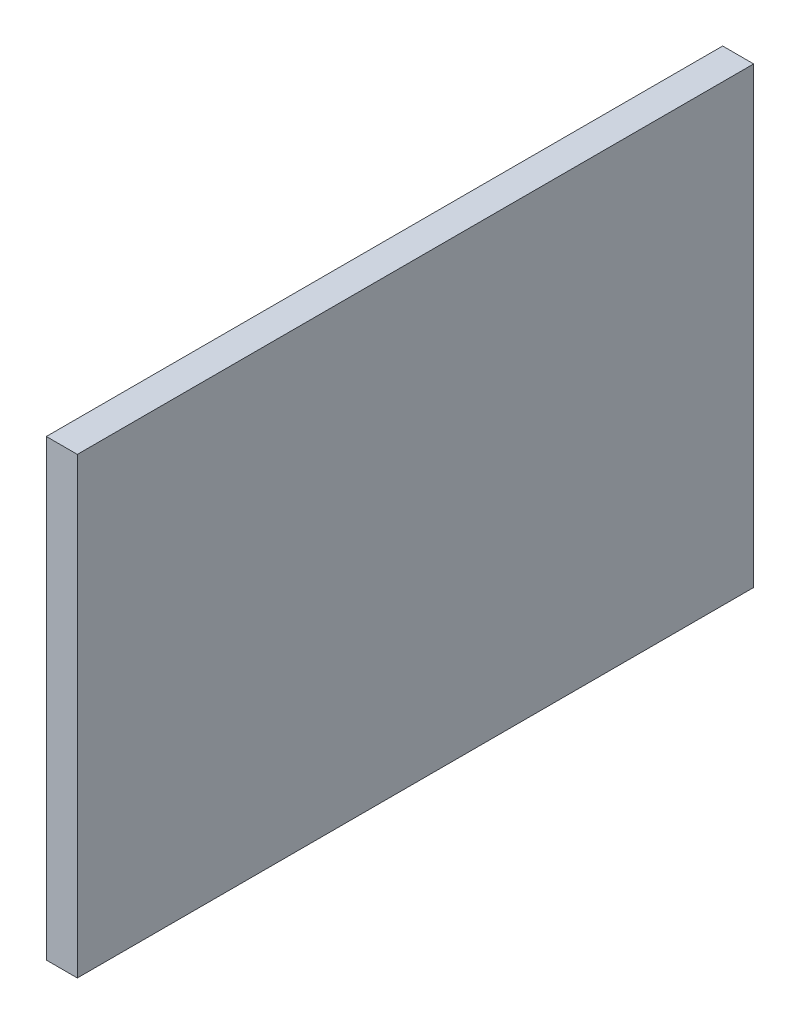
ISO-10303-21;
HEADER;
FILE_DESCRIPTION(('STEP AP214'),'2;1');
FILE_NAME('part.step','',(''),(''),'','','');
FILE_SCHEMA(('AUTOMOTIVE_DESIGN { 1 0 10303 214 1 1 1 1 }'));
ENDSEC;
DATA;
#1=APPLICATION_CONTEXT('core data for automotive mechanical design processes');
#2=APPLICATION_PROTOCOL_DEFINITION('international standard','automotive_design',2000,#1);
#3=PRODUCT_CONTEXT('',#1,'mechanical');
#4=PRODUCT('Part','Part','',(#3));
#5=PRODUCT_RELATED_PRODUCT_CATEGORY('part','',(#4));
#6=PRODUCT_DEFINITION_FORMATION('','',#4);
#7=PRODUCT_DEFINITION_CONTEXT('part definition',#1,'design');
#8=PRODUCT_DEFINITION('design','',#6,#7);
#9=PRODUCT_DEFINITION_SHAPE('','',#8);
#10=(LENGTH_UNIT() NAMED_UNIT(*) SI_UNIT(.MILLI.,.METRE.));
#11=(NAMED_UNIT(*) PLANE_ANGLE_UNIT() SI_UNIT($,.RADIAN.));
#12=(NAMED_UNIT(*) SI_UNIT($,.STERADIAN.) SOLID_ANGLE_UNIT());
#13=UNCERTAINTY_MEASURE_WITH_UNIT(LENGTH_MEASURE(1.E-05),#10,'distance_accuracy_value','');
#14=(GEOMETRIC_REPRESENTATION_CONTEXT(3) GLOBAL_UNCERTAINTY_ASSIGNED_CONTEXT((#13)) GLOBAL_UNIT_ASSIGNED_CONTEXT((#10,
#11,#12)) REPRESENTATION_CONTEXT('',''));
#15=CARTESIAN_POINT('',(0.,0.,0.));
#16=DIRECTION('',(0.,0.,1.));
#17=DIRECTION('',(1.,0.,0.));
#18=AXIS2_PLACEMENT_3D('',#15,#16,#17);
#19=CARTESIAN_POINT('',(1.59999999999999,46.17,90.48));
#20=DIRECTION('',(0.,0.,1.));
#21=DIRECTION('',(1.,0.,0.));
#22=AXIS2_PLACEMENT_3D('',#19,#20,#21);
#23=PLANE('',#22);
#24=DIRECTION('',(0.,1.,0.));
#25=VECTOR('',#24,1.);
#26=CARTESIAN_POINT('',(0.,46.17,90.48));
#27=LINE('',#26,#25);
#28=CARTESIAN_POINT('',(0.,46.17,90.48));
#29=VERTEX_POINT('',#28);
#30=CARTESIAN_POINT('',(0.,69.57,90.48));
#31=VERTEX_POINT('',#30);
#32=EDGE_CURVE('E102',#29,#31,#27,.T.);
#33=ORIENTED_EDGE('',*,*,#32,.T.);
#34=DIRECTION('',(-1.,0.,0.));
#35=VECTOR('',#34,1.);
#36=CARTESIAN_POINT('',(1.59999999999999,69.57,90.48));
#37=LINE('',#36,#35);
#38=CARTESIAN_POINT('',(1.59999999999999,69.57,90.48));
#39=VERTEX_POINT('',#38);
#40=EDGE_CURVE('E11',#39,#31,#37,.T.);
#41=ORIENTED_EDGE('',*,*,#40,.F.);
#42=DIRECTION('',(0.,1.,0.));
#43=VECTOR('',#42,1.);
#44=CARTESIAN_POINT('',(1.59999999999999,46.17,90.48));
#45=LINE('',#44,#43);
#46=CARTESIAN_POINT('',(1.59999999999999,46.17,90.48));
#47=VERTEX_POINT('',#46);
#48=EDGE_CURVE('E76',#47,#39,#45,.T.);
#49=ORIENTED_EDGE('',*,*,#48,.F.);
#50=DIRECTION('',(-1.,0.,0.));
#51=VECTOR('',#50,1.);
#52=CARTESIAN_POINT('',(1.59999999999999,46.17,90.48));
#53=LINE('',#52,#51);
#54=EDGE_CURVE('E100',#47,#29,#53,.T.);
#55=ORIENTED_EDGE('',*,*,#54,.T.);
#56=EDGE_LOOP('',(#33,#41,#49,#55));
#57=FACE_BOUND('',#56,.T.);
#58=ADVANCED_FACE('F39',(#57),#23,.F.);
#59=CARTESIAN_POINT('',(1.59999999999999,69.57,125.38));
#60=DIRECTION('',(0.,1.,0.));
#61=DIRECTION('',(0.,0.,1.));
#62=AXIS2_PLACEMENT_3D('',#59,#60,#61);
#63=PLANE('',#62);
#64=DIRECTION('',(0.,0.,-1.));
#65=VECTOR('',#64,1.);
#66=CARTESIAN_POINT('',(0.,69.57,125.38));
#67=LINE('',#66,#65);
#68=CARTESIAN_POINT('',(0.,69.57,125.38));
#69=VERTEX_POINT('',#68);
#70=EDGE_CURVE('E90',#69,#31,#67,.T.);
#71=ORIENTED_EDGE('',*,*,#70,.F.);
#72=DIRECTION('',(-1.,0.,0.));
#73=VECTOR('',#72,1.);
#74=CARTESIAN_POINT('',(1.59999999999999,69.57,125.38));
#75=LINE('',#74,#73);
#76=CARTESIAN_POINT('',(1.59999999999999,69.57,125.38));
#77=VERTEX_POINT('',#76);
#78=EDGE_CURVE('E50',#77,#69,#75,.T.);
#79=ORIENTED_EDGE('',*,*,#78,.F.);
#80=DIRECTION('',(0.,0.,-1.));
#81=VECTOR('',#80,1.);
#82=CARTESIAN_POINT('',(1.59999999999999,69.57,125.38));
#83=LINE('',#82,#81);
#84=EDGE_CURVE('E82',#77,#39,#83,.T.);
#85=ORIENTED_EDGE('',*,*,#84,.T.);
#86=ORIENTED_EDGE('',*,*,#40,.T.);
#87=EDGE_LOOP('',(#71,#79,#85,#86));
#88=FACE_BOUND('',#87,.T.);
#89=ADVANCED_FACE('F84',(#88),#63,.T.);
#90=CARTESIAN_POINT('',(1.59999999999999,46.17,125.38));
#91=DIRECTION('',(0.,0.,1.));
#92=DIRECTION('',(1.,0.,0.));
#93=AXIS2_PLACEMENT_3D('',#90,#91,#92);
#94=PLANE('',#93);
#95=DIRECTION('',(0.,1.,0.));
#96=VECTOR('',#95,1.);
#97=CARTESIAN_POINT('',(0.,46.17,125.38));
#98=LINE('',#97,#96);
#99=CARTESIAN_POINT('',(0.,46.17,125.38));
#100=VERTEX_POINT('',#99);
#101=EDGE_CURVE('E103',#100,#69,#98,.T.);
#102=ORIENTED_EDGE('',*,*,#101,.F.);
#103=DIRECTION('',(-1.,0.,0.));
#104=VECTOR('',#103,1.);
#105=CARTESIAN_POINT('',(1.59999999999999,46.17,125.38));
#106=LINE('',#105,#104);
#107=CARTESIAN_POINT('',(1.59999999999999,46.17,125.38));
#108=VERTEX_POINT('',#107);
#109=EDGE_CURVE('E68',#108,#100,#106,.T.);
#110=ORIENTED_EDGE('',*,*,#109,.F.);
#111=DIRECTION('',(0.,1.,0.));
#112=VECTOR('',#111,1.);
#113=CARTESIAN_POINT('',(1.59999999999999,46.17,125.38));
#114=LINE('',#113,#112);
#115=EDGE_CURVE('E93',#108,#77,#114,.T.);
#116=ORIENTED_EDGE('',*,*,#115,.T.);
#117=ORIENTED_EDGE('',*,*,#78,.T.);
#118=EDGE_LOOP('',(#102,#110,#116,#117));
#119=FACE_BOUND('',#118,.T.);
#120=ADVANCED_FACE('F94',(#119),#94,.T.);
#121=CARTESIAN_POINT('',(1.59999999999999,46.17,125.38));
#122=DIRECTION('',(0.,1.,0.));
#123=DIRECTION('',(0.,0.,1.));
#124=AXIS2_PLACEMENT_3D('',#121,#122,#123);
#125=PLANE('',#124);
#126=DIRECTION('',(0.,0.,-1.));
#127=VECTOR('',#126,1.);
#128=CARTESIAN_POINT('',(0.,46.17,125.38));
#129=LINE('',#128,#127);
#130=EDGE_CURVE('E74',#100,#29,#129,.T.);
#131=ORIENTED_EDGE('',*,*,#130,.T.);
#132=ORIENTED_EDGE('',*,*,#54,.F.);
#133=DIRECTION('',(0.,0.,-1.));
#134=VECTOR('',#133,1.);
#135=CARTESIAN_POINT('',(1.59999999999999,46.17,125.38));
#136=LINE('',#135,#134);
#137=EDGE_CURVE('E54',#108,#47,#136,.T.);
#138=ORIENTED_EDGE('',*,*,#137,.F.);
#139=ORIENTED_EDGE('',*,*,#109,.T.);
#140=EDGE_LOOP('',(#131,#132,#138,#139));
#141=FACE_BOUND('',#140,.T.);
#142=ADVANCED_FACE('F119',(#141),#125,.F.);
#143=CARTESIAN_POINT('',(1.59999999999999,0.,0.));
#144=DIRECTION('',(-1.,0.,0.));
#145=DIRECTION('',(0.,0.,1.));
#146=AXIS2_PLACEMENT_3D('',#143,#144,#145);
#147=PLANE('',#146);
#148=ORIENTED_EDGE('',*,*,#48,.T.);
#149=ORIENTED_EDGE('',*,*,#84,.F.);
#150=ORIENTED_EDGE('',*,*,#115,.F.);
#151=ORIENTED_EDGE('',*,*,#137,.T.);
#152=EDGE_LOOP('',(#148,#149,#150,#151));
#153=FACE_BOUND('',#152,.T.);
#154=ADVANCED_FACE('F95',(#153),#147,.F.);
#155=CARTESIAN_POINT('',(0.,0.,0.));
#156=DIRECTION('',(-1.,0.,0.));
#157=DIRECTION('',(0.,0.,1.));
#158=AXIS2_PLACEMENT_3D('',#155,#156,#157);
#159=PLANE('',#158);
#160=ORIENTED_EDGE('',*,*,#32,.F.);
#161=ORIENTED_EDGE('',*,*,#130,.F.);
#162=ORIENTED_EDGE('',*,*,#101,.T.);
#163=ORIENTED_EDGE('',*,*,#70,.T.);
#164=EDGE_LOOP('',(#160,#161,#162,#163));
#165=FACE_BOUND('',#164,.T.);
#166=ADVANCED_FACE('F115',(#165),#159,.T.);
#167=CLOSED_SHELL('',(#58,#89,#120,#142,#154,#166));
#168=MANIFOLD_SOLID_BREP('B2',#167);
#169=ADVANCED_BREP_SHAPE_REPRESENTATION('',(#18,#168),#14);
#170=SHAPE_DEFINITION_REPRESENTATION(#9,#169);
ENDSEC;
END-ISO-10303-21;
